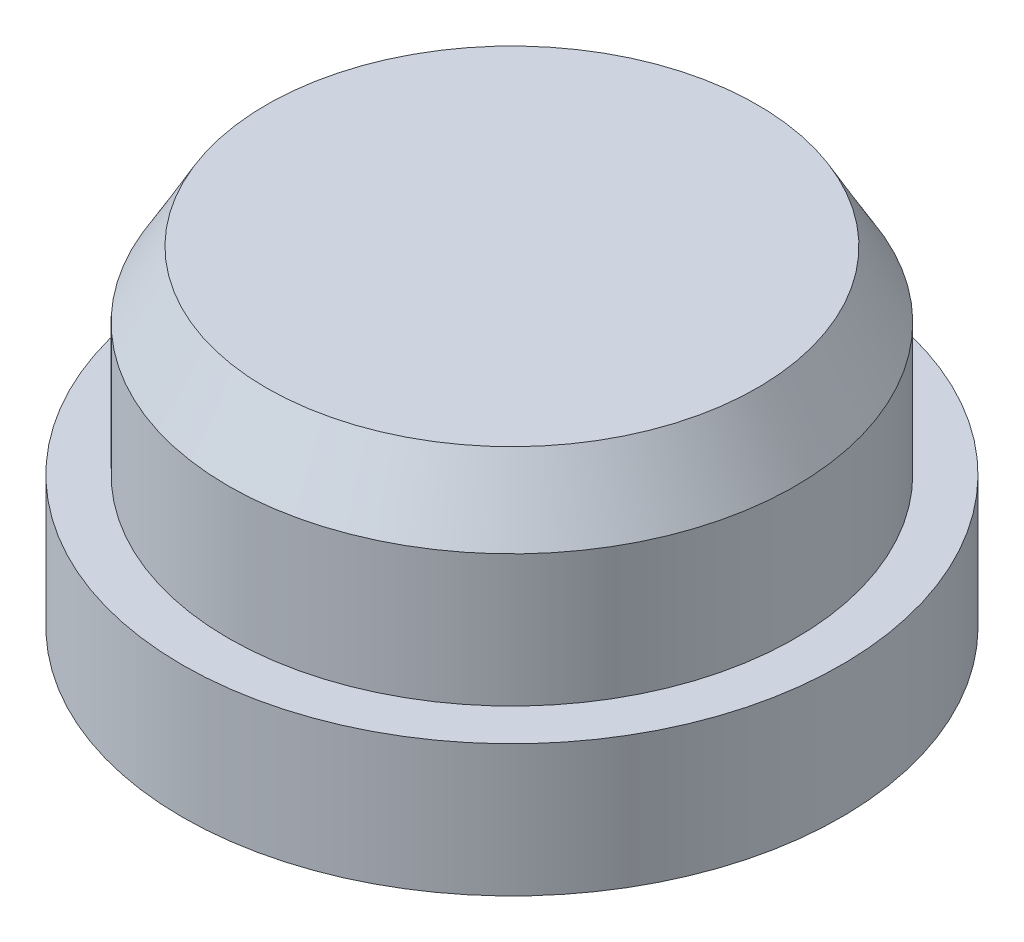
ISO-10303-21;
HEADER;
FILE_DESCRIPTION(('STEP AP214'),'2;1');
FILE_NAME('part.step','',(''),(''),'','','');
FILE_SCHEMA(('AUTOMOTIVE_DESIGN { 1 0 10303 214 1 1 1 1 }'));
ENDSEC;
DATA;
#1=APPLICATION_CONTEXT('core data for automotive mechanical design processes');
#2=APPLICATION_PROTOCOL_DEFINITION('international standard','automotive_design',2000,#1);
#3=PRODUCT_CONTEXT('',#1,'mechanical');
#4=PRODUCT('Part','Part','',(#3));
#5=PRODUCT_RELATED_PRODUCT_CATEGORY('part','',(#4));
#6=PRODUCT_DEFINITION_FORMATION('','',#4);
#7=PRODUCT_DEFINITION_CONTEXT('part definition',#1,'design');
#8=PRODUCT_DEFINITION('design','',#6,#7);
#9=PRODUCT_DEFINITION_SHAPE('','',#8);
#10=(LENGTH_UNIT() NAMED_UNIT(*) SI_UNIT(.MILLI.,.METRE.));
#11=(NAMED_UNIT(*) PLANE_ANGLE_UNIT() SI_UNIT($,.RADIAN.));
#12=(NAMED_UNIT(*) SI_UNIT($,.STERADIAN.) SOLID_ANGLE_UNIT());
#13=UNCERTAINTY_MEASURE_WITH_UNIT(LENGTH_MEASURE(1.E-05),#10,'distance_accuracy_value','');
#14=(GEOMETRIC_REPRESENTATION_CONTEXT(3) GLOBAL_UNCERTAINTY_ASSIGNED_CONTEXT((#13)) GLOBAL_UNIT_ASSIGNED_CONTEXT((#10,
#11,#12)) REPRESENTATION_CONTEXT('',''));
#15=CARTESIAN_POINT('',(0.,0.,0.));
#16=DIRECTION('',(0.,0.,1.));
#17=DIRECTION('',(1.,0.,0.));
#18=AXIS2_PLACEMENT_3D('',#15,#16,#17);
#19=CARTESIAN_POINT('',(0.,2.,0.));
#20=DIRECTION('',(0.,-1.,0.));
#21=DIRECTION('',(0.,0.,-1.));
#22=AXIS2_PLACEMENT_3D('',#19,#20,#21);
#23=CYLINDRICAL_SURFACE('',#22,5.);
#24=CARTESIAN_POINT('',(0.,2.,0.));
#25=DIRECTION('',(0.,1.,0.));
#26=DIRECTION('',(0.,0.,1.));
#27=AXIS2_PLACEMENT_3D('',#24,#25,#26);
#28=CIRCLE('',#27,5.);
#29=CARTESIAN_POINT('',(0.,2.,5.));
#30=VERTEX_POINT('',#29);
#31=EDGE_CURVE('E44',#30,#30,#28,.T.);
#32=ORIENTED_EDGE('',*,*,#31,.F.);
#33=EDGE_LOOP('',(#32));
#34=FACE_BOUND('',#33,.T.);
#35=CARTESIAN_POINT('',(0.,0.,0.));
#36=DIRECTION('',(0.,1.,0.));
#37=DIRECTION('',(0.,0.,1.));
#38=AXIS2_PLACEMENT_3D('',#35,#36,#37);
#39=CIRCLE('',#38,5.);
#40=CARTESIAN_POINT('',(0.,0.,5.));
#41=VERTEX_POINT('',#40);
#42=EDGE_CURVE('E48',#41,#41,#39,.T.);
#43=ORIENTED_EDGE('',*,*,#42,.T.);
#44=EDGE_LOOP('',(#43));
#45=FACE_BOUND('',#44,.T.);
#46=ADVANCED_FACE('F33',(#34,#45),#23,.T.);
#47=CARTESIAN_POINT('',(0.,2.,0.));
#48=DIRECTION('',(0.,1.,0.));
#49=DIRECTION('',(0.,0.,1.));
#50=AXIS2_PLACEMENT_3D('',#47,#48,#49);
#51=PLANE('',#50);
#52=CARTESIAN_POINT('',(0.,2.,0.));
#53=DIRECTION('',(0.,1.,0.));
#54=DIRECTION('',(0.,0.,1.));
#55=AXIS2_PLACEMENT_3D('',#52,#53,#54);
#56=CIRCLE('',#55,4.3);
#57=CARTESIAN_POINT('',(0.,2.,4.3));
#58=VERTEX_POINT('',#57);
#59=EDGE_CURVE('E52',#58,#58,#56,.T.);
#60=ORIENTED_EDGE('',*,*,#59,.F.);
#61=EDGE_LOOP('',(#60));
#62=FACE_BOUND('',#61,.T.);
#63=ORIENTED_EDGE('',*,*,#31,.T.);
#64=EDGE_LOOP('',(#63));
#65=FACE_BOUND('',#64,.T.);
#66=ADVANCED_FACE('F59',(#62,#65),#51,.T.);
#67=CARTESIAN_POINT('',(0.,0.,0.));
#68=DIRECTION('',(0.,1.,0.));
#69=DIRECTION('',(0.,0.,1.));
#70=AXIS2_PLACEMENT_3D('',#67,#68,#69);
#71=PLANE('',#70);
#72=ORIENTED_EDGE('',*,*,#42,.F.);
#73=EDGE_LOOP('',(#72));
#74=FACE_BOUND('',#73,.T.);
#75=ADVANCED_FACE('F62',(#74),#71,.F.);
#76=CARTESIAN_POINT('',(0.,5.,0.));
#77=DIRECTION('',(0.,-1.,0.));
#78=DIRECTION('',(0.,0.,-1.));
#79=AXIS2_PLACEMENT_3D('',#76,#77,#78);
#80=CYLINDRICAL_SURFACE('',#79,4.3);
#81=CARTESIAN_POINT('',(0.,3.99999999999999,0.));
#82=DIRECTION('',(0.,1.,0.));
#83=DIRECTION('',(0.,0.,1.));
#84=AXIS2_PLACEMENT_3D('',#81,#82,#83);
#85=CIRCLE('',#84,4.3);
#86=CARTESIAN_POINT('',(0.,3.99999999999999,4.3));
#87=VERTEX_POINT('',#86);
#88=EDGE_CURVE('E10',#87,#87,#85,.F.);
#89=ORIENTED_EDGE('',*,*,#88,.T.);
#90=EDGE_LOOP('',(#89));
#91=FACE_BOUND('',#90,.T.);
#92=ORIENTED_EDGE('',*,*,#59,.T.);
#93=EDGE_LOOP('',(#92));
#94=FACE_BOUND('',#93,.T.);
#95=ADVANCED_FACE('F57',(#91,#94),#80,.T.);
#96=CARTESIAN_POINT('',(0.,5.,0.));
#97=DIRECTION('',(0.,1.,0.));
#98=DIRECTION('',(0.,0.,1.));
#99=AXIS2_PLACEMENT_3D('',#96,#97,#98);
#100=PLANE('',#99);
#101=CARTESIAN_POINT('',(0.,5.,0.));
#102=DIRECTION('',(0.,1.,0.));
#103=DIRECTION('',(0.,0.,1.));
#104=AXIS2_PLACEMENT_3D('',#101,#102,#103);
#105=CIRCLE('',#104,3.72264973081037);
#106=CARTESIAN_POINT('',(0.,5.,3.72264973081037));
#107=VERTEX_POINT('',#106);
#108=EDGE_CURVE('E40',#107,#107,#105,.T.);
#109=ORIENTED_EDGE('',*,*,#108,.T.);
#110=EDGE_LOOP('',(#109));
#111=FACE_BOUND('',#110,.T.);
#112=ADVANCED_FACE('F75',(#111),#100,.T.);
#113=CARTESIAN_POINT('',(0.,5.,0.));
#114=DIRECTION('',(0.,-1.,0.));
#115=DIRECTION('',(0.,0.,-1.));
#116=AXIS2_PLACEMENT_3D('',#113,#114,#115);
#117=CONICAL_SURFACE('',#116,3.72264973081037,0.523598775598296);
#118=ORIENTED_EDGE('',*,*,#88,.F.);
#119=EDGE_LOOP('',(#118));
#120=FACE_BOUND('',#119,.T.);
#121=ORIENTED_EDGE('',*,*,#108,.F.);
#122=EDGE_LOOP('',(#121));
#123=FACE_BOUND('',#122,.T.);
#124=ADVANCED_FACE('F35',(#120,#123),#117,.T.);
#125=CLOSED_SHELL('',(#46,#66,#75,#95,#112,#124));
#126=MANIFOLD_SOLID_BREP('B2',#125);
#127=ADVANCED_BREP_SHAPE_REPRESENTATION('',(#18,#126),#14);
#128=SHAPE_DEFINITION_REPRESENTATION(#9,#127);
ENDSEC;
END-ISO-10303-21;
